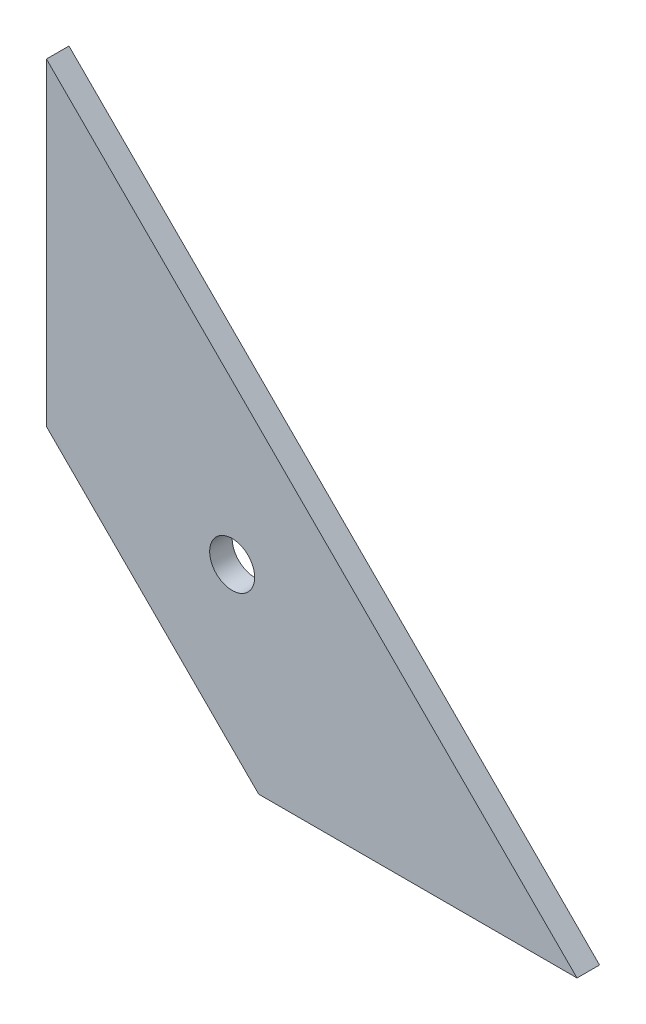
ISO-10303-21;
HEADER;
FILE_DESCRIPTION(('STEP AP214'),'2;1');
FILE_NAME('part.step','',(''),(''),'','','');
FILE_SCHEMA(('AUTOMOTIVE_DESIGN { 1 0 10303 214 1 1 1 1 }'));
ENDSEC;
DATA;
#1=APPLICATION_CONTEXT('core data for automotive mechanical design processes');
#2=APPLICATION_PROTOCOL_DEFINITION('international standard','automotive_design',2000,#1);
#3=PRODUCT_CONTEXT('',#1,'mechanical');
#4=PRODUCT('Part','Part','',(#3));
#5=PRODUCT_RELATED_PRODUCT_CATEGORY('part','',(#4));
#6=PRODUCT_DEFINITION_FORMATION('','',#4);
#7=PRODUCT_DEFINITION_CONTEXT('part definition',#1,'design');
#8=PRODUCT_DEFINITION('design','',#6,#7);
#9=PRODUCT_DEFINITION_SHAPE('','',#8);
#10=(LENGTH_UNIT() NAMED_UNIT(*) SI_UNIT(.MILLI.,.METRE.));
#11=(NAMED_UNIT(*) PLANE_ANGLE_UNIT() SI_UNIT($,.RADIAN.));
#12=(NAMED_UNIT(*) SI_UNIT($,.STERADIAN.) SOLID_ANGLE_UNIT());
#13=UNCERTAINTY_MEASURE_WITH_UNIT(LENGTH_MEASURE(1.E-05),#10,'distance_accuracy_value','');
#14=(GEOMETRIC_REPRESENTATION_CONTEXT(3) GLOBAL_UNCERTAINTY_ASSIGNED_CONTEXT((#13)) GLOBAL_UNIT_ASSIGNED_CONTEXT((#10,
#11,#12)) REPRESENTATION_CONTEXT('',''));
#15=CARTESIAN_POINT('',(0.,0.,0.));
#16=DIRECTION('',(0.,0.,1.));
#17=DIRECTION('',(1.,0.,0.));
#18=AXIS2_PLACEMENT_3D('',#15,#16,#17);
#19=CARTESIAN_POINT('',(-3.78679656440344,390.,-69.5000000000051));
#20=DIRECTION('',(0.,0.,1.));
#21=DIRECTION('',(1.,0.,0.));
#22=AXIS2_PLACEMENT_3D('',#19,#20,#21);
#23=PLANE('',#22);
#24=CARTESIAN_POINT('',(-203.535533905932,14.7487373415292,-69.5000000000217));
#25=DIRECTION('',(0.,0.,1.));
#26=DIRECTION('',(1.,0.,0.));
#27=AXIS2_PLACEMENT_3D('',#24,#25,#26);
#28=CIRCLE('',#27,3.00000000000001);
#29=CARTESIAN_POINT('',(-200.535533905932,14.7487373415292,-69.5000000000214));
#30=VERTEX_POINT('',#29);
#31=EDGE_CURVE('E20',#30,#30,#28,.T.);
#32=ORIENTED_EDGE('',*,*,#31,.T.);
#33=EDGE_LOOP('',(#32));
#34=FACE_BOUND('',#33,.T.);
#35=DIRECTION('',(0.,1.,0.));
#36=VECTOR('',#35,1.);
#37=CARTESIAN_POINT('',(-228.284271247461,60.7106781186548,-69.5000000000237));
#38=LINE('',#37,#36);
#39=CARTESIAN_POINT('',(-228.284271247461,60.7106781186547,-69.5000000000222));
#40=VERTEX_POINT('',#39);
#41=CARTESIAN_POINT('',(-228.284271247461,18.284271247462,-69.5000000000237));
#42=VERTEX_POINT('',#41);
#43=EDGE_CURVE('E81',#40,#42,#38,.F.);
#44=ORIENTED_EDGE('',*,*,#43,.F.);
#45=DIRECTION('',(-0.707106781186547,0.707106781186548,0.));
#46=VECTOR('',#45,1.);
#47=CARTESIAN_POINT('',(-157.573593128807,-9.99999999999996,-69.5000000000178));
#48=LINE('',#47,#46);
#49=CARTESIAN_POINT('',(-157.573593128807,-9.99999999999996,-69.5000000000187));
#50=VERTEX_POINT('',#49);
#51=EDGE_CURVE('E54',#50,#40,#48,.T.);
#52=ORIENTED_EDGE('',*,*,#51,.F.);
#53=DIRECTION('',(1.,0.,0.));
#54=VECTOR('',#53,1.);
#55=CARTESIAN_POINT('',(-199.999999999999,-9.99999999999995,-69.5000000000213));
#56=LINE('',#55,#54);
#57=CARTESIAN_POINT('',(-199.999999999999,-9.99999999999996,-69.5000000000219));
#58=VERTEX_POINT('',#57);
#59=EDGE_CURVE('E56',#58,#50,#56,.T.);
#60=ORIENTED_EDGE('',*,*,#59,.F.);
#61=DIRECTION('',(0.707106781186548,-0.707106781186547,0.));
#62=VECTOR('',#61,1.);
#63=CARTESIAN_POINT('',(-228.284271247461,18.2842712474619,-69.5000000000237));
#64=LINE('',#63,#62);
#65=EDGE_CURVE('E58',#42,#58,#64,.T.);
#66=ORIENTED_EDGE('',*,*,#65,.F.);
#67=EDGE_LOOP('',(#44,#52,#60,#66));
#68=FACE_BOUND('',#67,.T.);
#69=ADVANCED_FACE('F17',(#34,#68),#23,.F.);
#70=CARTESIAN_POINT('',(-228.284271247461,18.2842712474619,-69.5000000000237));
#71=DIRECTION('',(-0.707106781186547,-0.707106781186548,0.));
#72=DIRECTION('',(0.707106781186548,-0.707106781186547,0.));
#73=AXIS2_PLACEMENT_3D('',#70,#71,#72);
#74=PLANE('',#73);
#75=DIRECTION('',(0.707106781186549,-0.707106781186546,0.));
#76=VECTOR('',#75,1.);
#77=CARTESIAN_POINT('',(-228.284271247462,18.2842712474619,-66.5000000000237));
#78=LINE('',#77,#76);
#79=CARTESIAN_POINT('',(-228.284271247462,18.2842712474621,-66.5000000000225));
#80=VERTEX_POINT('',#79);
#81=CARTESIAN_POINT('',(-200.,-10.,-66.5000000000204));
#82=VERTEX_POINT('',#81);
#83=EDGE_CURVE('E85',#80,#82,#78,.T.);
#84=ORIENTED_EDGE('',*,*,#83,.F.);
#85=DIRECTION('',(0.,0.,1.));
#86=VECTOR('',#85,1.);
#87=CARTESIAN_POINT('',(-228.284271247461,18.2842712474619,-69.5000000000237));
#88=LINE('',#87,#86);
#89=EDGE_CURVE('E69',#42,#80,#88,.T.);
#90=ORIENTED_EDGE('',*,*,#89,.F.);
#91=ORIENTED_EDGE('',*,*,#65,.T.);
#92=DIRECTION('',(0.,0.,-1.));
#93=VECTOR('',#92,1.);
#94=CARTESIAN_POINT('',(-200.,-9.99999999999995,-69.5000000000213));
#95=LINE('',#94,#93);
#96=EDGE_CURVE('E63',#82,#58,#95,.T.);
#97=ORIENTED_EDGE('',*,*,#96,.F.);
#98=EDGE_LOOP('',(#84,#90,#91,#97));
#99=FACE_BOUND('',#98,.T.);
#100=ADVANCED_FACE('F66',(#99),#74,.T.);
#101=CARTESIAN_POINT('',(-199.999999999999,-9.99999999999995,-69.5000000000213));
#102=DIRECTION('',(0.,-1.,0.));
#103=DIRECTION('',(0.,0.,-1.));
#104=AXIS2_PLACEMENT_3D('',#101,#102,#103);
#105=PLANE('',#104);
#106=DIRECTION('',(1.,0.,0.));
#107=VECTOR('',#106,1.);
#108=CARTESIAN_POINT('',(-3.78679656440369,-9.99999999999995,-66.5000000000051));
#109=LINE('',#108,#107);
#110=CARTESIAN_POINT('',(-157.573593128807,-9.99999999999998,-66.5000000000193));
#111=VERTEX_POINT('',#110);
#112=EDGE_CURVE('E74',#82,#111,#109,.T.);
#113=ORIENTED_EDGE('',*,*,#112,.F.);
#114=ORIENTED_EDGE('',*,*,#96,.T.);
#115=ORIENTED_EDGE('',*,*,#59,.T.);
#116=DIRECTION('',(0.,0.,1.));
#117=VECTOR('',#116,1.);
#118=CARTESIAN_POINT('',(-157.573593128807,-9.99999999999997,-69.5000000000178));
#119=LINE('',#118,#117);
#120=EDGE_CURVE('E77',#111,#50,#119,.F.);
#121=ORIENTED_EDGE('',*,*,#120,.F.);
#122=EDGE_LOOP('',(#113,#114,#115,#121));
#123=FACE_BOUND('',#122,.T.);
#124=ADVANCED_FACE('F72',(#123),#105,.T.);
#125=CARTESIAN_POINT('',(-157.573593128807,-9.99999999999996,-69.5000000000178));
#126=DIRECTION('',(0.707106781186548,0.707106781186547,0.));
#127=DIRECTION('',(-0.707106781186547,0.707106781186548,0.));
#128=AXIS2_PLACEMENT_3D('',#125,#126,#127);
#129=PLANE('',#128);
#130=DIRECTION('',(-0.707106781186548,0.707106781186547,0.));
#131=VECTOR('',#130,1.);
#132=CARTESIAN_POINT('',(-157.573593128807,-9.99999999999995,-66.5000000000178));
#133=LINE('',#132,#131);
#134=CARTESIAN_POINT('',(-228.284271247462,60.7106781186546,-66.5000000000237));
#135=VERTEX_POINT('',#134);
#136=EDGE_CURVE('E88',#111,#135,#133,.T.);
#137=ORIENTED_EDGE('',*,*,#136,.F.);
#138=ORIENTED_EDGE('',*,*,#120,.T.);
#139=ORIENTED_EDGE('',*,*,#51,.T.);
#140=DIRECTION('',(0.,0.,1.));
#141=VECTOR('',#140,1.);
#142=CARTESIAN_POINT('',(-228.284271247461,60.7106781186548,-69.5000000000237));
#143=LINE('',#142,#141);
#144=EDGE_CURVE('E34',#135,#40,#143,.F.);
#145=ORIENTED_EDGE('',*,*,#144,.F.);
#146=EDGE_LOOP('',(#137,#138,#139,#145));
#147=FACE_BOUND('',#146,.T.);
#148=ADVANCED_FACE('F96',(#147),#129,.T.);
#149=CARTESIAN_POINT('',(-228.284271247461,60.7106781186548,-69.5000000000237));
#150=DIRECTION('',(-1.,0.,0.));
#151=DIRECTION('',(0.,0.,1.));
#152=AXIS2_PLACEMENT_3D('',#149,#150,#151);
#153=PLANE('',#152);
#154=DIRECTION('',(0.,1.,0.));
#155=VECTOR('',#154,1.);
#156=CARTESIAN_POINT('',(-228.284271247462,390.,-66.5000000000237));
#157=LINE('',#156,#155);
#158=EDGE_CURVE('E26',#135,#80,#157,.F.);
#159=ORIENTED_EDGE('',*,*,#158,.F.);
#160=ORIENTED_EDGE('',*,*,#144,.T.);
#161=ORIENTED_EDGE('',*,*,#43,.T.);
#162=ORIENTED_EDGE('',*,*,#89,.T.);
#163=EDGE_LOOP('',(#159,#160,#161,#162));
#164=FACE_BOUND('',#163,.T.);
#165=ADVANCED_FACE('F95',(#164),#153,.T.);
#166=CARTESIAN_POINT('',(-203.535533905932,14.7487373415292,-69.5000000000216));
#167=DIRECTION('',(0.,0.,1.));
#168=DIRECTION('',(1.,0.,0.));
#169=AXIS2_PLACEMENT_3D('',#166,#167,#168);
#170=CYLINDRICAL_SURFACE('',#169,3.00000000000001);
#171=ORIENTED_EDGE('',*,*,#31,.F.);
#172=EDGE_LOOP('',(#171));
#173=FACE_BOUND('',#172,.T.);
#174=CARTESIAN_POINT('',(-203.535533905932,14.7487373415292,-66.5000000000217));
#175=DIRECTION('',(0.,0.,1.));
#176=DIRECTION('',(1.,0.,0.));
#177=AXIS2_PLACEMENT_3D('',#174,#175,#176);
#178=CIRCLE('',#177,3.00000000000001);
#179=CARTESIAN_POINT('',(-200.535533905932,14.7487373415292,-66.5000000000214));
#180=VERTEX_POINT('',#179);
#181=EDGE_CURVE('E11',#180,#180,#178,.F.);
#182=ORIENTED_EDGE('',*,*,#181,.F.);
#183=EDGE_LOOP('',(#182));
#184=FACE_BOUND('',#183,.T.);
#185=ADVANCED_FACE('F104',(#173,#184),#170,.F.);
#186=CARTESIAN_POINT('',(-3.78679656440369,390.,-66.5000000000051));
#187=DIRECTION('',(0.,0.,1.));
#188=DIRECTION('',(1.,0.,0.));
#189=AXIS2_PLACEMENT_3D('',#186,#187,#188);
#190=PLANE('',#189);
#191=ORIENTED_EDGE('',*,*,#181,.T.);
#192=EDGE_LOOP('',(#191));
#193=FACE_BOUND('',#192,.T.);
#194=ORIENTED_EDGE('',*,*,#136,.T.);
#195=ORIENTED_EDGE('',*,*,#158,.T.);
#196=ORIENTED_EDGE('',*,*,#83,.T.);
#197=ORIENTED_EDGE('',*,*,#112,.T.);
#198=EDGE_LOOP('',(#194,#195,#196,#197));
#199=FACE_BOUND('',#198,.T.);
#200=ADVANCED_FACE('F93',(#193,#199),#190,.T.);
#201=CLOSED_SHELL('',(#69,#100,#124,#148,#165,#185,#200));
#202=MANIFOLD_SOLID_BREP('B1',#201);
#203=ADVANCED_BREP_SHAPE_REPRESENTATION('',(#18,#202),#14);
#204=SHAPE_DEFINITION_REPRESENTATION(#9,#203);
ENDSEC;
END-ISO-10303-21;
